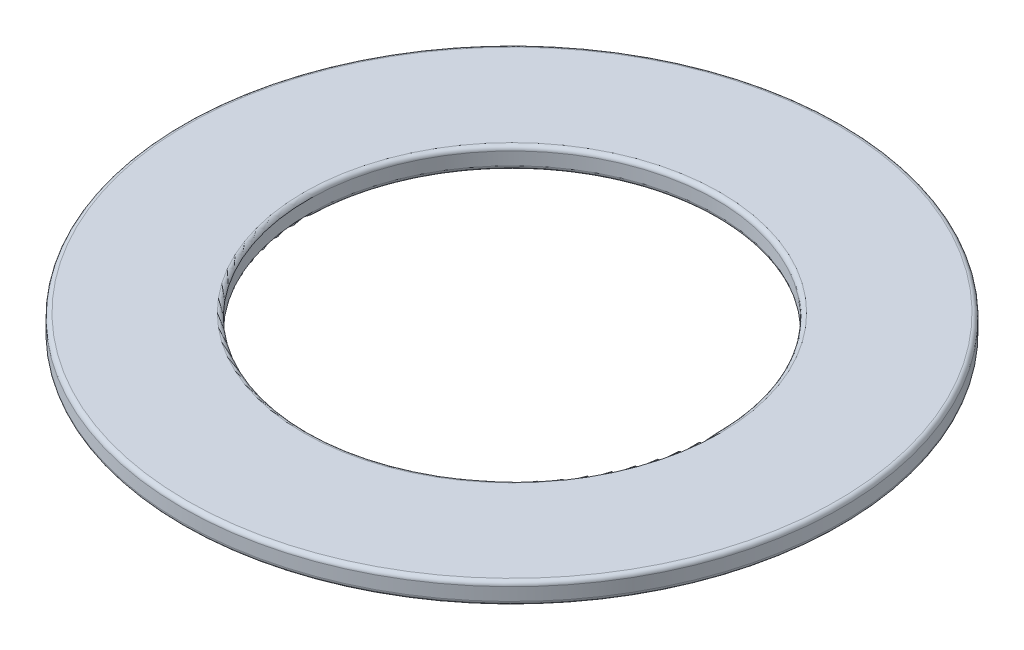
ISO-10303-21;
HEADER;
FILE_DESCRIPTION(('STEP AP214'),'2;1');
FILE_NAME('part.step','',(''),(''),'','','');
FILE_SCHEMA(('AUTOMOTIVE_DESIGN { 1 0 10303 214 1 1 1 1 }'));
ENDSEC;
DATA;
#1=APPLICATION_CONTEXT('core data for automotive mechanical design processes');
#2=APPLICATION_PROTOCOL_DEFINITION('international standard','automotive_design',2000,#1);
#3=PRODUCT_CONTEXT('',#1,'mechanical');
#4=PRODUCT('Part','Part','',(#3));
#5=PRODUCT_RELATED_PRODUCT_CATEGORY('part','',(#4));
#6=PRODUCT_DEFINITION_FORMATION('','',#4);
#7=PRODUCT_DEFINITION_CONTEXT('part definition',#1,'design');
#8=PRODUCT_DEFINITION('design','',#6,#7);
#9=PRODUCT_DEFINITION_SHAPE('','',#8);
#10=(LENGTH_UNIT() NAMED_UNIT(*) SI_UNIT(.MILLI.,.METRE.));
#11=(NAMED_UNIT(*) PLANE_ANGLE_UNIT() SI_UNIT($,.RADIAN.));
#12=(NAMED_UNIT(*) SI_UNIT($,.STERADIAN.) SOLID_ANGLE_UNIT());
#13=UNCERTAINTY_MEASURE_WITH_UNIT(LENGTH_MEASURE(1.E-05),#10,'distance_accuracy_value','');
#14=(GEOMETRIC_REPRESENTATION_CONTEXT(3) GLOBAL_UNCERTAINTY_ASSIGNED_CONTEXT((#13)) GLOBAL_UNIT_ASSIGNED_CONTEXT((#10,
#11,#12)) REPRESENTATION_CONTEXT('',''));
#15=CARTESIAN_POINT('',(0.,0.,0.));
#16=DIRECTION('',(0.,0.,1.));
#17=DIRECTION('',(1.,0.,0.));
#18=AXIS2_PLACEMENT_3D('',#15,#16,#17);
#19=CARTESIAN_POINT('',(0.,0.5,0.));
#20=DIRECTION('',(0.,1.,0.));
#21=DIRECTION('',(0.,0.,1.));
#22=AXIS2_PLACEMENT_3D('',#19,#20,#21);
#23=PLANE('',#22);
#24=CARTESIAN_POINT('',(0.,0.5,0.));
#25=DIRECTION('',(0.,1.,0.));
#26=DIRECTION('',(0.,0.,1.));
#27=AXIS2_PLACEMENT_3D('',#24,#25,#26);
#28=CIRCLE('',#27,4.9);
#29=CARTESIAN_POINT('',(0.,0.5,4.9));
#30=VERTEX_POINT('',#29);
#31=EDGE_CURVE('E10',#30,#30,#28,.F.);
#32=ORIENTED_EDGE('',*,*,#31,.T.);
#33=EDGE_LOOP('',(#32));
#34=FACE_BOUND('',#33,.T.);
#35=CARTESIAN_POINT('',(0.,0.5,0.));
#36=DIRECTION('',(0.,1.,0.));
#37=DIRECTION('',(0.,0.,1.));
#38=AXIS2_PLACEMENT_3D('',#35,#36,#37);
#39=CIRCLE('',#38,7.65);
#40=CARTESIAN_POINT('',(0.,0.5,7.65));
#41=VERTEX_POINT('',#40);
#42=EDGE_CURVE('E38',#41,#41,#39,.T.);
#43=ORIENTED_EDGE('',*,*,#42,.T.);
#44=EDGE_LOOP('',(#43));
#45=FACE_BOUND('',#44,.T.);
#46=ADVANCED_FACE('F31',(#34,#45),#23,.T.);
#47=CARTESIAN_POINT('',(0.,0.,0.));
#48=DIRECTION('',(0.,1.,0.));
#49=DIRECTION('',(0.,0.,1.));
#50=AXIS2_PLACEMENT_3D('',#47,#48,#49);
#51=PLANE('',#50);
#52=CARTESIAN_POINT('',(0.,0.,0.));
#53=DIRECTION('',(0.,1.,0.));
#54=DIRECTION('',(0.,0.,1.));
#55=AXIS2_PLACEMENT_3D('',#52,#53,#54);
#56=CIRCLE('',#55,4.9);
#57=CARTESIAN_POINT('',(0.,0.,4.9));
#58=VERTEX_POINT('',#57);
#59=EDGE_CURVE('E57',#58,#58,#56,.T.);
#60=ORIENTED_EDGE('',*,*,#59,.T.);
#61=EDGE_LOOP('',(#60));
#62=FACE_BOUND('',#61,.T.);
#63=CARTESIAN_POINT('',(0.,0.,0.));
#64=DIRECTION('',(0.,1.,0.));
#65=DIRECTION('',(0.,0.,1.));
#66=AXIS2_PLACEMENT_3D('',#63,#64,#65);
#67=CIRCLE('',#66,7.65);
#68=CARTESIAN_POINT('',(0.,0.,7.65));
#69=VERTEX_POINT('',#68);
#70=EDGE_CURVE('E60',#69,#69,#67,.F.);
#71=ORIENTED_EDGE('',*,*,#70,.T.);
#72=EDGE_LOOP('',(#71));
#73=FACE_BOUND('',#72,.T.);
#74=ADVANCED_FACE('F64',(#62,#73),#51,.F.);
#75=CARTESIAN_POINT('',(0.,0.5,0.));
#76=DIRECTION('',(0.,-1.,0.));
#77=DIRECTION('',(0.,0.,-1.));
#78=AXIS2_PLACEMENT_3D('',#75,#76,#77);
#79=CYLINDRICAL_SURFACE('',#78,7.75);
#80=CARTESIAN_POINT('',(0.,0.1,0.));
#81=DIRECTION('',(0.,1.,0.));
#82=DIRECTION('',(0.,0.,1.));
#83=AXIS2_PLACEMENT_3D('',#80,#81,#82);
#84=CIRCLE('',#83,7.75);
#85=CARTESIAN_POINT('',(0.,0.1,7.75));
#86=VERTEX_POINT('',#85);
#87=EDGE_CURVE('E42',#86,#86,#84,.T.);
#88=ORIENTED_EDGE('',*,*,#87,.T.);
#89=EDGE_LOOP('',(#88));
#90=FACE_BOUND('',#89,.T.);
#91=CARTESIAN_POINT('',(0.,0.4,0.));
#92=DIRECTION('',(0.,1.,0.));
#93=DIRECTION('',(0.,0.,1.));
#94=AXIS2_PLACEMENT_3D('',#91,#92,#93);
#95=CIRCLE('',#94,7.75);
#96=CARTESIAN_POINT('',(0.,0.4,7.75));
#97=VERTEX_POINT('',#96);
#98=EDGE_CURVE('E46',#97,#97,#95,.F.);
#99=ORIENTED_EDGE('',*,*,#98,.T.);
#100=EDGE_LOOP('',(#99));
#101=FACE_BOUND('',#100,.T.);
#102=ADVANCED_FACE('F74',(#90,#101),#79,.T.);
#103=CARTESIAN_POINT('',(0.,0.5,0.));
#104=DIRECTION('',(0.,-1.,0.));
#105=DIRECTION('',(0.,0.,-1.));
#106=AXIS2_PLACEMENT_3D('',#103,#104,#105);
#107=CYLINDRICAL_SURFACE('',#106,4.8);
#108=CARTESIAN_POINT('',(0.,0.1,0.));
#109=DIRECTION('',(0.,1.,0.));
#110=DIRECTION('',(0.,0.,1.));
#111=AXIS2_PLACEMENT_3D('',#108,#109,#110);
#112=CIRCLE('',#111,4.8);
#113=CARTESIAN_POINT('',(0.,0.1,4.8));
#114=VERTEX_POINT('',#113);
#115=EDGE_CURVE('E51',#114,#114,#112,.F.);
#116=ORIENTED_EDGE('',*,*,#115,.T.);
#117=EDGE_LOOP('',(#116));
#118=FACE_BOUND('',#117,.T.);
#119=CARTESIAN_POINT('',(0.,0.4,0.));
#120=DIRECTION('',(0.,1.,0.));
#121=DIRECTION('',(0.,0.,1.));
#122=AXIS2_PLACEMENT_3D('',#119,#120,#121);
#123=CIRCLE('',#122,4.8);
#124=CARTESIAN_POINT('',(0.,0.4,4.8));
#125=VERTEX_POINT('',#124);
#126=EDGE_CURVE('E54',#125,#125,#123,.T.);
#127=ORIENTED_EDGE('',*,*,#126,.T.);
#128=EDGE_LOOP('',(#127));
#129=FACE_BOUND('',#128,.T.);
#130=ADVANCED_FACE('F77',(#118,#129),#107,.F.);
#131=CARTESIAN_POINT('',(0.,0.1,0.));
#132=DIRECTION('',(0.,1.,0.));
#133=DIRECTION('',(0.,0.,1.));
#134=AXIS2_PLACEMENT_3D('',#131,#132,#133);
#135=TOROIDAL_SURFACE('',#134,4.9,0.1);
#136=ORIENTED_EDGE('',*,*,#115,.F.);
#137=EDGE_LOOP('',(#136));
#138=FACE_BOUND('',#137,.T.);
#139=ORIENTED_EDGE('',*,*,#59,.F.);
#140=EDGE_LOOP('',(#139));
#141=FACE_BOUND('',#140,.T.);
#142=ADVANCED_FACE('F70',(#138,#141),#135,.T.);
#143=CARTESIAN_POINT('',(0.,0.1,0.));
#144=DIRECTION('',(0.,1.,0.));
#145=DIRECTION('',(0.,0.,1.));
#146=AXIS2_PLACEMENT_3D('',#143,#144,#145);
#147=TOROIDAL_SURFACE('',#146,7.65,0.1);
#148=ORIENTED_EDGE('',*,*,#70,.F.);
#149=EDGE_LOOP('',(#148));
#150=FACE_BOUND('',#149,.T.);
#151=ORIENTED_EDGE('',*,*,#87,.F.);
#152=EDGE_LOOP('',(#151));
#153=FACE_BOUND('',#152,.T.);
#154=ADVANCED_FACE('F66',(#150,#153),#147,.T.);
#155=CARTESIAN_POINT('',(0.,0.4,0.));
#156=DIRECTION('',(0.,1.,0.));
#157=DIRECTION('',(0.,0.,1.));
#158=AXIS2_PLACEMENT_3D('',#155,#156,#157);
#159=TOROIDAL_SURFACE('',#158,4.9,0.1);
#160=ORIENTED_EDGE('',*,*,#31,.F.);
#161=EDGE_LOOP('',(#160));
#162=FACE_BOUND('',#161,.T.);
#163=ORIENTED_EDGE('',*,*,#126,.F.);
#164=EDGE_LOOP('',(#163));
#165=FACE_BOUND('',#164,.T.);
#166=ADVANCED_FACE('F69',(#162,#165),#159,.T.);
#167=CARTESIAN_POINT('',(0.,0.4,0.));
#168=DIRECTION('',(0.,1.,0.));
#169=DIRECTION('',(0.,0.,1.));
#170=AXIS2_PLACEMENT_3D('',#167,#168,#169);
#171=TOROIDAL_SURFACE('',#170,7.65,0.1);
#172=ORIENTED_EDGE('',*,*,#98,.F.);
#173=EDGE_LOOP('',(#172));
#174=FACE_BOUND('',#173,.T.);
#175=ORIENTED_EDGE('',*,*,#42,.F.);
#176=EDGE_LOOP('',(#175));
#177=FACE_BOUND('',#176,.T.);
#178=ADVANCED_FACE('F33',(#174,#177),#171,.T.);
#179=CLOSED_SHELL('',(#46,#74,#102,#130,#142,#154,#166,#178));
#180=MANIFOLD_SOLID_BREP('B2',#179);
#181=ADVANCED_BREP_SHAPE_REPRESENTATION('',(#18,#180),#14);
#182=SHAPE_DEFINITION_REPRESENTATION(#9,#181);
ENDSEC;
END-ISO-10303-21;
